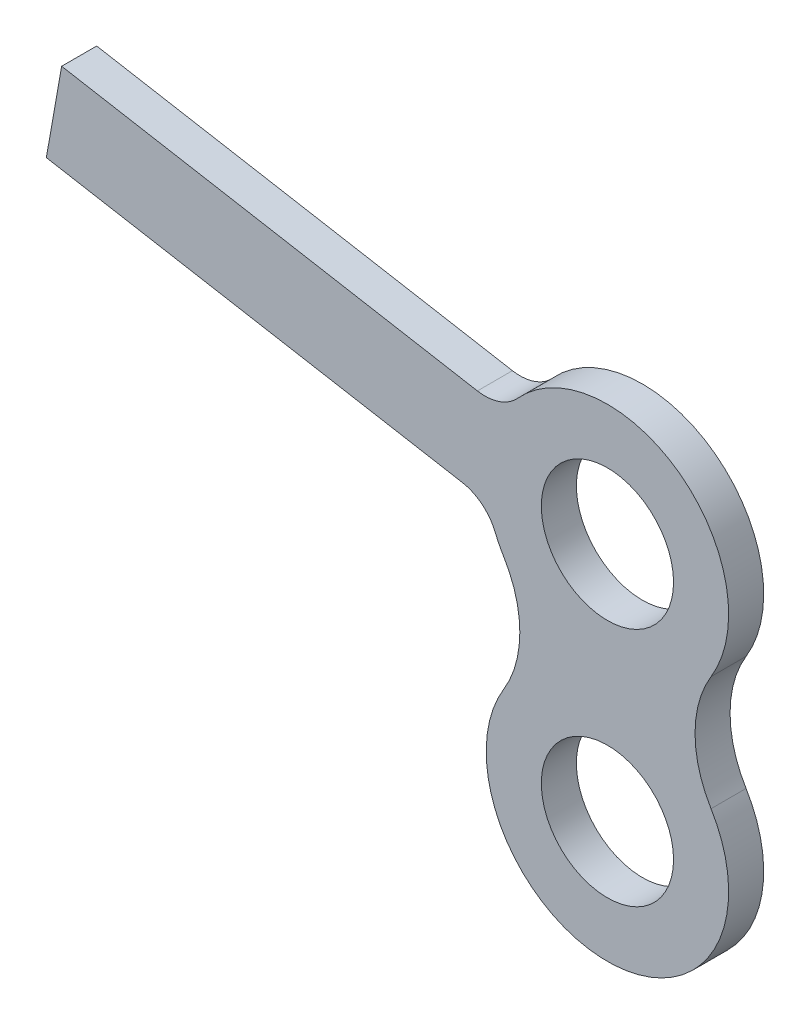
ISO-10303-21;
HEADER;
FILE_DESCRIPTION(('STEP AP214'),'2;1');
FILE_NAME('part.step','',(''),(''),'','','');
FILE_SCHEMA(('AUTOMOTIVE_DESIGN { 1 0 10303 214 1 1 1 1 }'));
ENDSEC;
DATA;
#1=APPLICATION_CONTEXT('core data for automotive mechanical design processes');
#2=APPLICATION_PROTOCOL_DEFINITION('international standard','automotive_design',2000,#1);
#3=PRODUCT_CONTEXT('',#1,'mechanical');
#4=PRODUCT('Part','Part','',(#3));
#5=PRODUCT_RELATED_PRODUCT_CATEGORY('part','',(#4));
#6=PRODUCT_DEFINITION_FORMATION('','',#4);
#7=PRODUCT_DEFINITION_CONTEXT('part definition',#1,'design');
#8=PRODUCT_DEFINITION('design','',#6,#7);
#9=PRODUCT_DEFINITION_SHAPE('','',#8);
#10=(LENGTH_UNIT() NAMED_UNIT(*) SI_UNIT(.MILLI.,.METRE.));
#11=(NAMED_UNIT(*) PLANE_ANGLE_UNIT() SI_UNIT($,.RADIAN.));
#12=(NAMED_UNIT(*) SI_UNIT($,.STERADIAN.) SOLID_ANGLE_UNIT());
#13=UNCERTAINTY_MEASURE_WITH_UNIT(LENGTH_MEASURE(1.E-05),#10,'distance_accuracy_value','');
#14=(GEOMETRIC_REPRESENTATION_CONTEXT(3) GLOBAL_UNCERTAINTY_ASSIGNED_CONTEXT((#13)) GLOBAL_UNIT_ASSIGNED_CONTEXT((#10,
#11,#12)) REPRESENTATION_CONTEXT('',''));
#15=CARTESIAN_POINT('',(0.,0.,0.));
#16=DIRECTION('',(0.,0.,1.));
#17=DIRECTION('',(1.,0.,0.));
#18=AXIS2_PLACEMENT_3D('',#15,#16,#17);
#19=CARTESIAN_POINT('',(-5.55331205759789,15.9409051955912,1.59));
#20=DIRECTION('',(0.,0.,-1.));
#21=DIRECTION('',(-1.,0.,0.));
#22=AXIS2_PLACEMENT_3D('',#19,#20,#21);
#23=CYLINDRICAL_SURFACE('',#22,2.);
#24=CARTESIAN_POINT('',(-5.55331205759789,15.9409051955912,0.));
#25=DIRECTION('',(0.,0.,1.));
#26=DIRECTION('',(1.,0.,0.));
#27=AXIS2_PLACEMENT_3D('',#24,#25,#26);
#28=CIRCLE('',#27,2.);
#29=CARTESIAN_POINT('',(-5.90060841293176,13.9712896895667,0.));
#30=VERTEX_POINT('',#29);
#31=CARTESIAN_POINT('',(-4.07242884223846,14.5966638101002,0.));
#32=VERTEX_POINT('',#31);
#33=EDGE_CURVE('E146',#30,#32,#28,.T.);
#34=ORIENTED_EDGE('',*,*,#33,.F.);
#35=DIRECTION('',(0.,0.,-1.));
#36=VECTOR('',#35,1.);
#37=CARTESIAN_POINT('',(-5.90060841293176,13.9712896895667,1.59));
#38=LINE('',#37,#36);
#39=CARTESIAN_POINT('',(-5.90060841293176,13.9712896895667,1.59));
#40=VERTEX_POINT('',#39);
#41=EDGE_CURVE('E11',#40,#30,#38,.T.);
#42=ORIENTED_EDGE('',*,*,#41,.F.);
#43=CARTESIAN_POINT('',(-5.55331205759789,15.9409051955912,1.59));
#44=DIRECTION('',(0.,0.,1.));
#45=DIRECTION('',(1.,0.,0.));
#46=AXIS2_PLACEMENT_3D('',#43,#44,#45);
#47=CIRCLE('',#46,2.);
#48=CARTESIAN_POINT('',(-4.07242884223846,14.5966638101002,1.59));
#49=VERTEX_POINT('',#48);
#50=EDGE_CURVE('E176',#40,#49,#47,.T.);
#51=ORIENTED_EDGE('',*,*,#50,.T.);
#52=DIRECTION('',(0.,0.,-1.));
#53=VECTOR('',#52,1.);
#54=CARTESIAN_POINT('',(-4.07242884223846,14.5966638101002,1.59));
#55=LINE('',#54,#53);
#56=EDGE_CURVE('E92',#49,#32,#55,.T.);
#57=ORIENTED_EDGE('',*,*,#56,.T.);
#58=EDGE_LOOP('',(#34,#42,#51,#57));
#59=FACE_BOUND('',#58,.T.);
#60=ADVANCED_FACE('F35',(#59),#23,.F.);
#61=CARTESIAN_POINT('',(2.2113061364588,12.5409402893076,1.59));
#62=DIRECTION('',(-0.173648177666934,-0.984807753012207,0.));
#63=DIRECTION('',(0.984807753012207,-0.173648177666934,0.));
#64=AXIS2_PLACEMENT_3D('',#61,#62,#63);
#65=PLANE('',#64);
#66=DIRECTION('',(-0.984807753012208,0.173648177666934,0.));
#67=VECTOR('',#66,1.);
#68=CARTESIAN_POINT('',(2.2113061364588,12.5409402893076,0.));
#69=LINE('',#68,#67);
#70=CARTESIAN_POINT('',(-24.7653013464774,17.2976440365312,0.));
#71=VERTEX_POINT('',#70);
#72=EDGE_CURVE('E149',#30,#71,#69,.T.);
#73=ORIENTED_EDGE('',*,*,#72,.T.);
#74=DIRECTION('',(0.,0.,-1.));
#75=VECTOR('',#74,1.);
#76=CARTESIAN_POINT('',(-24.7653013464774,17.2976440365312,1.59));
#77=LINE('',#76,#75);
#78=CARTESIAN_POINT('',(-24.7653013464774,17.2976440365312,1.59));
#79=VERTEX_POINT('',#78);
#80=EDGE_CURVE('E43',#79,#71,#77,.T.);
#81=ORIENTED_EDGE('',*,*,#80,.F.);
#82=DIRECTION('',(-0.984807753012208,0.173648177666934,0.));
#83=VECTOR('',#82,1.);
#84=CARTESIAN_POINT('',(2.2113061364588,12.5409402893076,1.59));
#85=LINE('',#84,#83);
#86=EDGE_CURVE('E214',#40,#79,#85,.T.);
#87=ORIENTED_EDGE('',*,*,#86,.F.);
#88=ORIENTED_EDGE('',*,*,#41,.T.);
#89=EDGE_LOOP('',(#73,#81,#87,#88));
#90=FACE_BOUND('',#89,.T.);
#91=ADVANCED_FACE('F226',(#90),#65,.F.);
#92=CARTESIAN_POINT('',(-26.9766074829362,4.75670374722361,1.59));
#93=DIRECTION('',(0.984807753012207,-0.173648177666933,0.));
#94=DIRECTION('',(0.173648177666933,0.984807753012208,0.));
#95=AXIS2_PLACEMENT_3D('',#92,#93,#94);
#96=PLANE('',#95);
#97=DIRECTION('',(-0.173648177666933,-0.984807753012208,0.));
#98=VECTOR('',#97,1.);
#99=CARTESIAN_POINT('',(-26.9766074829362,4.75670374722361,0.));
#100=LINE('',#99,#98);
#101=CARTESIAN_POINT('',(-25.4598940571452,13.3584130244824,0.));
#102=VERTEX_POINT('',#101);
#103=EDGE_CURVE('E151',#71,#102,#100,.T.);
#104=ORIENTED_EDGE('',*,*,#103,.T.);
#105=DIRECTION('',(0.,0.,-1.));
#106=VECTOR('',#105,1.);
#107=CARTESIAN_POINT('',(-25.4598940571452,13.3584130244824,1.59));
#108=LINE('',#107,#106);
#109=CARTESIAN_POINT('',(-25.4598940571452,13.3584130244824,1.59));
#110=VERTEX_POINT('',#109);
#111=EDGE_CURVE('E186',#110,#102,#108,.T.);
#112=ORIENTED_EDGE('',*,*,#111,.F.);
#113=DIRECTION('',(-0.173648177666933,-0.984807753012208,0.));
#114=VECTOR('',#113,1.);
#115=CARTESIAN_POINT('',(-26.9766074829362,4.75670374722361,1.59));
#116=LINE('',#115,#114);
#117=EDGE_CURVE('E194',#79,#110,#116,.T.);
#118=ORIENTED_EDGE('',*,*,#117,.F.);
#119=ORIENTED_EDGE('',*,*,#80,.T.);
#120=EDGE_LOOP('',(#104,#112,#118,#119));
#121=FACE_BOUND('',#120,.T.);
#122=ADVANCED_FACE('F192',(#121),#96,.F.);
#123=CARTESIAN_POINT('',(1.51671342579106,8.60170927725877,1.59));
#124=DIRECTION('',(-0.173648177666934,-0.984807753012207,0.));
#125=DIRECTION('',(0.984807753012207,-0.173648177666934,0.));
#126=AXIS2_PLACEMENT_3D('',#123,#124,#125);
#127=PLANE('',#126);
#128=DIRECTION('',(-0.984807753012208,0.173648177666934,0.));
#129=VECTOR('',#128,1.);
#130=CARTESIAN_POINT('',(1.51671342579106,8.60170927725877,0.));
#131=LINE('',#130,#129);
#132=CARTESIAN_POINT('',(-6.59520112359949,10.0320586775179,0.));
#133=VERTEX_POINT('',#132);
#134=EDGE_CURVE('E154',#133,#102,#131,.T.);
#135=ORIENTED_EDGE('',*,*,#134,.F.);
#136=DIRECTION('',(0.,0.,-1.));
#137=VECTOR('',#136,1.);
#138=CARTESIAN_POINT('',(-6.59520112359949,10.0320586775179,1.59));
#139=LINE('',#138,#137);
#140=CARTESIAN_POINT('',(-6.59520112359949,10.0320586775179,1.59));
#141=VERTEX_POINT('',#140);
#142=EDGE_CURVE('E184',#141,#133,#139,.T.);
#143=ORIENTED_EDGE('',*,*,#142,.F.);
#144=DIRECTION('',(-0.984807753012208,0.173648177666934,0.));
#145=VECTOR('',#144,1.);
#146=CARTESIAN_POINT('',(1.51671342579106,8.60170927725877,1.59));
#147=LINE('',#146,#145);
#148=EDGE_CURVE('E207',#141,#110,#147,.T.);
#149=ORIENTED_EDGE('',*,*,#148,.T.);
#150=ORIENTED_EDGE('',*,*,#111,.T.);
#151=EDGE_LOOP('',(#135,#143,#149,#150));
#152=FACE_BOUND('',#151,.T.);
#153=ADVANCED_FACE('F204',(#152),#127,.T.);
#154=CARTESIAN_POINT('',(-6.94249747893336,8.06244317149349,1.59));
#155=DIRECTION('',(0.,0.,-1.));
#156=DIRECTION('',(-1.,0.,0.));
#157=AXIS2_PLACEMENT_3D('',#154,#155,#156);
#158=CYLINDRICAL_SURFACE('',#157,2.);
#159=CARTESIAN_POINT('',(-6.94249747893336,8.06244317149349,0.));
#160=DIRECTION('',(0.,0.,1.));
#161=DIRECTION('',(1.,0.,0.));
#162=AXIS2_PLACEMENT_3D('',#159,#160,#161);
#163=CIRCLE('',#162,2.);
#164=CARTESIAN_POINT('',(-5.09116481788447,8.81912499242856,0.));
#165=VERTEX_POINT('',#164);
#166=EDGE_CURVE('E157',#165,#133,#163,.T.);
#167=ORIENTED_EDGE('',*,*,#166,.F.);
#168=DIRECTION('',(0.,0.,-1.));
#169=VECTOR('',#168,1.);
#170=CARTESIAN_POINT('',(-5.09116481788447,8.81912499242856,1.59));
#171=LINE('',#170,#169);
#172=CARTESIAN_POINT('',(-5.09116481788447,8.81912499242856,1.59));
#173=VERTEX_POINT('',#172);
#174=EDGE_CURVE('E182',#173,#165,#171,.T.);
#175=ORIENTED_EDGE('',*,*,#174,.F.);
#176=CARTESIAN_POINT('',(-6.94249747893336,8.06244317149349,1.59));
#177=DIRECTION('',(0.,0.,1.));
#178=DIRECTION('',(1.,0.,0.));
#179=AXIS2_PLACEMENT_3D('',#176,#177,#178);
#180=CIRCLE('',#179,2.);
#181=EDGE_CURVE('E210',#173,#141,#180,.T.);
#182=ORIENTED_EDGE('',*,*,#181,.T.);
#183=ORIENTED_EDGE('',*,*,#142,.T.);
#184=EDGE_LOOP('',(#167,#175,#182,#183));
#185=FACE_BOUND('',#184,.T.);
#186=ADVANCED_FACE('F236',(#185),#158,.F.);
#187=CARTESIAN_POINT('',(0.,10.9,1.59));
#188=DIRECTION('',(0.,0.,-1.));
#189=DIRECTION('',(-1.,0.,0.));
#190=AXIS2_PLACEMENT_3D('',#187,#188,#189);
#191=CYLINDRICAL_SURFACE('',#190,5.5);
#192=CARTESIAN_POINT('',(0.,10.9,0.));
#193=DIRECTION('',(0.,0.,1.));
#194=DIRECTION('',(1.,0.,0.));
#195=AXIS2_PLACEMENT_3D('',#192,#193,#194);
#196=CIRCLE('',#195,5.5);
#197=CARTESIAN_POINT('',(-4.70109928284015,8.0452380952381,0.));
#198=VERTEX_POINT('',#197);
#199=EDGE_CURVE('E160',#165,#198,#196,.T.);
#200=ORIENTED_EDGE('',*,*,#199,.T.);
#201=DIRECTION('',(0.,0.,-1.));
#202=VECTOR('',#201,1.);
#203=CARTESIAN_POINT('',(-4.70109928284015,8.0452380952381,1.59));
#204=LINE('',#203,#202);
#205=CARTESIAN_POINT('',(-4.70109928284015,8.0452380952381,1.59));
#206=VERTEX_POINT('',#205);
#207=EDGE_CURVE('E180',#206,#198,#204,.T.);
#208=ORIENTED_EDGE('',*,*,#207,.F.);
#209=CARTESIAN_POINT('',(0.,10.9,1.59));
#210=DIRECTION('',(0.,0.,1.));
#211=DIRECTION('',(1.,0.,0.));
#212=AXIS2_PLACEMENT_3D('',#209,#210,#211);
#213=CIRCLE('',#212,5.5);
#214=EDGE_CURVE('E212',#173,#206,#213,.T.);
#215=ORIENTED_EDGE('',*,*,#214,.F.);
#216=ORIENTED_EDGE('',*,*,#174,.T.);
#217=EDGE_LOOP('',(#200,#208,#215,#216));
#218=FACE_BOUND('',#217,.T.);
#219=ADVANCED_FACE('F239',(#218),#191,.T.);
#220=CARTESIAN_POINT('',(-8.97482590360393,5.45,1.59));
#221=DIRECTION('',(0.,0.,-1.));
#222=DIRECTION('',(-1.,0.,0.));
#223=AXIS2_PLACEMENT_3D('',#220,#221,#222);
#224=CYLINDRICAL_SURFACE('',#223,5.);
#225=CARTESIAN_POINT('',(-8.97482590360393,5.45,0.));
#226=DIRECTION('',(0.,0.,1.));
#227=DIRECTION('',(1.,0.,0.));
#228=AXIS2_PLACEMENT_3D('',#225,#226,#227);
#229=CIRCLE('',#228,5.);
#230=CARTESIAN_POINT('',(-4.70109928284015,2.8547619047619,0.));
#231=VERTEX_POINT('',#230);
#232=EDGE_CURVE('E163',#231,#198,#229,.T.);
#233=ORIENTED_EDGE('',*,*,#232,.F.);
#234=DIRECTION('',(0.,0.,-1.));
#235=VECTOR('',#234,1.);
#236=CARTESIAN_POINT('',(-4.70109928284015,2.8547619047619,1.59));
#237=LINE('',#236,#235);
#238=CARTESIAN_POINT('',(-4.70109928284015,2.8547619047619,1.59));
#239=VERTEX_POINT('',#238);
#240=EDGE_CURVE('E132',#239,#231,#237,.T.);
#241=ORIENTED_EDGE('',*,*,#240,.F.);
#242=CARTESIAN_POINT('',(-8.97482590360393,5.45,1.59));
#243=DIRECTION('',(0.,0.,1.));
#244=DIRECTION('',(1.,0.,0.));
#245=AXIS2_PLACEMENT_3D('',#242,#243,#244);
#246=CIRCLE('',#245,5.);
#247=EDGE_CURVE('E125',#239,#206,#246,.T.);
#248=ORIENTED_EDGE('',*,*,#247,.T.);
#249=ORIENTED_EDGE('',*,*,#207,.T.);
#250=EDGE_LOOP('',(#233,#241,#248,#249));
#251=FACE_BOUND('',#250,.T.);
#252=ADVANCED_FACE('F220',(#251),#224,.F.);
#253=CARTESIAN_POINT('',(0.,0.,1.59));
#254=DIRECTION('',(0.,0.,-1.));
#255=DIRECTION('',(-1.,0.,0.));
#256=AXIS2_PLACEMENT_3D('',#253,#254,#255);
#257=CYLINDRICAL_SURFACE('',#256,5.5);
#258=CARTESIAN_POINT('',(0.,0.,0.));
#259=DIRECTION('',(0.,0.,1.));
#260=DIRECTION('',(1.,0.,0.));
#261=AXIS2_PLACEMENT_3D('',#258,#259,#260);
#262=CIRCLE('',#261,5.5);
#263=CARTESIAN_POINT('',(4.70109928284015,2.8547619047619,0.));
#264=VERTEX_POINT('',#263);
#265=EDGE_CURVE('E131',#231,#264,#262,.T.);
#266=ORIENTED_EDGE('',*,*,#265,.T.);
#267=DIRECTION('',(0.,0.,-1.));
#268=VECTOR('',#267,1.);
#269=CARTESIAN_POINT('',(4.70109928284015,2.8547619047619,1.59));
#270=LINE('',#269,#268);
#271=CARTESIAN_POINT('',(4.70109928284015,2.8547619047619,1.59));
#272=VERTEX_POINT('',#271);
#273=EDGE_CURVE('E128',#272,#264,#270,.T.);
#274=ORIENTED_EDGE('',*,*,#273,.F.);
#275=CARTESIAN_POINT('',(0.,0.,1.59));
#276=DIRECTION('',(0.,0.,1.));
#277=DIRECTION('',(1.,0.,0.));
#278=AXIS2_PLACEMENT_3D('',#275,#276,#277);
#279=CIRCLE('',#278,5.5);
#280=EDGE_CURVE('E118',#239,#272,#279,.T.);
#281=ORIENTED_EDGE('',*,*,#280,.F.);
#282=ORIENTED_EDGE('',*,*,#240,.T.);
#283=EDGE_LOOP('',(#266,#274,#281,#282));
#284=FACE_BOUND('',#283,.T.);
#285=ADVANCED_FACE('F129',(#284),#257,.T.);
#286=CARTESIAN_POINT('',(8.97482590360393,5.45,1.59));
#287=DIRECTION('',(0.,0.,-1.));
#288=DIRECTION('',(-1.,0.,0.));
#289=AXIS2_PLACEMENT_3D('',#286,#287,#288);
#290=CYLINDRICAL_SURFACE('',#289,5.);
#291=CARTESIAN_POINT('',(8.97482590360393,5.45,0.));
#292=DIRECTION('',(0.,0.,1.));
#293=DIRECTION('',(1.,0.,0.));
#294=AXIS2_PLACEMENT_3D('',#291,#292,#293);
#295=CIRCLE('',#294,5.);
#296=CARTESIAN_POINT('',(4.70109928284015,8.04523809523809,0.));
#297=VERTEX_POINT('',#296);
#298=EDGE_CURVE('E85',#264,#297,#295,.F.);
#299=ORIENTED_EDGE('',*,*,#298,.T.);
#300=DIRECTION('',(0.,0.,-1.));
#301=VECTOR('',#300,1.);
#302=CARTESIAN_POINT('',(4.70109928284015,8.04523809523809,1.59));
#303=LINE('',#302,#301);
#304=CARTESIAN_POINT('',(4.70109928284015,8.04523809523809,1.59));
#305=VERTEX_POINT('',#304);
#306=EDGE_CURVE('E133',#305,#297,#303,.T.);
#307=ORIENTED_EDGE('',*,*,#306,.F.);
#308=CARTESIAN_POINT('',(8.97482590360393,5.45,1.59));
#309=DIRECTION('',(0.,0.,1.));
#310=DIRECTION('',(1.,0.,0.));
#311=AXIS2_PLACEMENT_3D('',#308,#309,#310);
#312=CIRCLE('',#311,5.);
#313=EDGE_CURVE('E123',#272,#305,#312,.F.);
#314=ORIENTED_EDGE('',*,*,#313,.F.);
#315=ORIENTED_EDGE('',*,*,#273,.T.);
#316=EDGE_LOOP('',(#299,#307,#314,#315));
#317=FACE_BOUND('',#316,.T.);
#318=ADVANCED_FACE('F135',(#317),#290,.F.);
#319=CARTESIAN_POINT('',(0.,0.,1.59));
#320=DIRECTION('',(0.,0.,-1.));
#321=DIRECTION('',(-1.,0.,0.));
#322=AXIS2_PLACEMENT_3D('',#319,#320,#321);
#323=CYLINDRICAL_SURFACE('',#322,3.);
#324=CARTESIAN_POINT('',(0.,0.,1.59));
#325=DIRECTION('',(0.,0.,1.));
#326=DIRECTION('',(1.,0.,0.));
#327=AXIS2_PLACEMENT_3D('',#324,#325,#326);
#328=CIRCLE('',#327,3.);
#329=CARTESIAN_POINT('',(3.,0.,1.59));
#330=VERTEX_POINT('',#329);
#331=EDGE_CURVE('E137',#330,#330,#328,.T.);
#332=ORIENTED_EDGE('',*,*,#331,.T.);
#333=EDGE_LOOP('',(#332));
#334=FACE_BOUND('',#333,.T.);
#335=CARTESIAN_POINT('',(0.,0.,0.));
#336=DIRECTION('',(0.,0.,1.));
#337=DIRECTION('',(1.,0.,0.));
#338=AXIS2_PLACEMENT_3D('',#335,#336,#337);
#339=CIRCLE('',#338,3.);
#340=CARTESIAN_POINT('',(3.,0.,0.));
#341=VERTEX_POINT('',#340);
#342=EDGE_CURVE('E170',#341,#341,#339,.T.);
#343=ORIENTED_EDGE('',*,*,#342,.F.);
#344=EDGE_LOOP('',(#343));
#345=FACE_BOUND('',#344,.T.);
#346=ADVANCED_FACE('F250',(#334,#345),#323,.F.);
#347=CARTESIAN_POINT('',(0.,10.9,1.59));
#348=DIRECTION('',(0.,0.,-1.));
#349=DIRECTION('',(-1.,0.,0.));
#350=AXIS2_PLACEMENT_3D('',#347,#348,#349);
#351=CYLINDRICAL_SURFACE('',#350,5.5);
#352=CARTESIAN_POINT('',(0.,10.9,0.));
#353=DIRECTION('',(0.,0.,1.));
#354=DIRECTION('',(1.,0.,0.));
#355=AXIS2_PLACEMENT_3D('',#352,#353,#354);
#356=CIRCLE('',#355,5.5);
#357=EDGE_CURVE('E168',#297,#32,#356,.T.);
#358=ORIENTED_EDGE('',*,*,#357,.T.);
#359=ORIENTED_EDGE('',*,*,#56,.F.);
#360=CARTESIAN_POINT('',(0.,10.9,1.59));
#361=DIRECTION('',(0.,0.,1.));
#362=DIRECTION('',(1.,0.,0.));
#363=AXIS2_PLACEMENT_3D('',#360,#361,#362);
#364=CIRCLE('',#363,5.5);
#365=EDGE_CURVE('E51',#305,#49,#364,.T.);
#366=ORIENTED_EDGE('',*,*,#365,.F.);
#367=ORIENTED_EDGE('',*,*,#306,.T.);
#368=EDGE_LOOP('',(#358,#359,#366,#367));
#369=FACE_BOUND('',#368,.T.);
#370=ADVANCED_FACE('F224',(#369),#351,.T.);
#371=CARTESIAN_POINT('',(0.,10.9,1.59));
#372=DIRECTION('',(0.,0.,-1.));
#373=DIRECTION('',(-1.,0.,0.));
#374=AXIS2_PLACEMENT_3D('',#371,#372,#373);
#375=CYLINDRICAL_SURFACE('',#374,3.);
#376=CARTESIAN_POINT('',(0.,10.9,1.59));
#377=DIRECTION('',(0.,0.,1.));
#378=DIRECTION('',(1.,0.,0.));
#379=AXIS2_PLACEMENT_3D('',#376,#377,#378);
#380=CIRCLE('',#379,3.);
#381=CARTESIAN_POINT('',(3.,10.9,1.59));
#382=VERTEX_POINT('',#381);
#383=EDGE_CURVE('E143',#382,#382,#380,.T.);
#384=ORIENTED_EDGE('',*,*,#383,.T.);
#385=EDGE_LOOP('',(#384));
#386=FACE_BOUND('',#385,.T.);
#387=CARTESIAN_POINT('',(0.,10.9,0.));
#388=DIRECTION('',(0.,0.,1.));
#389=DIRECTION('',(1.,0.,0.));
#390=AXIS2_PLACEMENT_3D('',#387,#388,#389);
#391=CIRCLE('',#390,3.);
#392=CARTESIAN_POINT('',(3.,10.9,0.));
#393=VERTEX_POINT('',#392);
#394=EDGE_CURVE('E173',#393,#393,#391,.T.);
#395=ORIENTED_EDGE('',*,*,#394,.F.);
#396=EDGE_LOOP('',(#395));
#397=FACE_BOUND('',#396,.T.);
#398=ADVANCED_FACE('F253',(#386,#397),#375,.F.);
#399=CARTESIAN_POINT('',(0.,0.,1.59));
#400=DIRECTION('',(0.,0.,1.));
#401=DIRECTION('',(1.,0.,0.));
#402=AXIS2_PLACEMENT_3D('',#399,#400,#401);
#403=PLANE('',#402);
#404=ORIENTED_EDGE('',*,*,#50,.F.);
#405=ORIENTED_EDGE('',*,*,#86,.T.);
#406=ORIENTED_EDGE('',*,*,#117,.T.);
#407=ORIENTED_EDGE('',*,*,#148,.F.);
#408=ORIENTED_EDGE('',*,*,#181,.F.);
#409=ORIENTED_EDGE('',*,*,#214,.T.);
#410=ORIENTED_EDGE('',*,*,#247,.F.);
#411=ORIENTED_EDGE('',*,*,#280,.T.);
#412=ORIENTED_EDGE('',*,*,#313,.T.);
#413=ORIENTED_EDGE('',*,*,#365,.T.);
#414=EDGE_LOOP('',(#404,#405,#406,#407,#408,#409,#410,#411,#412,#413));
#415=FACE_BOUND('',#414,.T.);
#416=ORIENTED_EDGE('',*,*,#331,.F.);
#417=EDGE_LOOP('',(#416));
#418=FACE_BOUND('',#417,.T.);
#419=ORIENTED_EDGE('',*,*,#383,.F.);
#420=EDGE_LOOP('',(#419));
#421=FACE_BOUND('',#420,.T.);
#422=ADVANCED_FACE('F120',(#415,#418,#421),#403,.T.);
#423=CARTESIAN_POINT('',(0.,0.,0.));
#424=DIRECTION('',(0.,0.,1.));
#425=DIRECTION('',(1.,0.,0.));
#426=AXIS2_PLACEMENT_3D('',#423,#424,#425);
#427=PLANE('',#426);
#428=ORIENTED_EDGE('',*,*,#33,.T.);
#429=ORIENTED_EDGE('',*,*,#357,.F.);
#430=ORIENTED_EDGE('',*,*,#298,.F.);
#431=ORIENTED_EDGE('',*,*,#265,.F.);
#432=ORIENTED_EDGE('',*,*,#232,.T.);
#433=ORIENTED_EDGE('',*,*,#199,.F.);
#434=ORIENTED_EDGE('',*,*,#166,.T.);
#435=ORIENTED_EDGE('',*,*,#134,.T.);
#436=ORIENTED_EDGE('',*,*,#103,.F.);
#437=ORIENTED_EDGE('',*,*,#72,.F.);
#438=EDGE_LOOP('',(#428,#429,#430,#431,#432,#433,#434,#435,#436,#437));
#439=FACE_BOUND('',#438,.T.);
#440=ORIENTED_EDGE('',*,*,#342,.T.);
#441=EDGE_LOOP('',(#440));
#442=FACE_BOUND('',#441,.T.);
#443=ORIENTED_EDGE('',*,*,#394,.T.);
#444=EDGE_LOOP('',(#443));
#445=FACE_BOUND('',#444,.T.);
#446=ADVANCED_FACE('F198',(#439,#442,#445),#427,.F.);
#447=CLOSED_SHELL('',(#60,#91,#122,#153,#186,#219,#252,#285,#318,#346,#370,#398,#422,#446));
#448=MANIFOLD_SOLID_BREP('B2',#447);
#449=ADVANCED_BREP_SHAPE_REPRESENTATION('',(#18,#448),#14);
#450=SHAPE_DEFINITION_REPRESENTATION(#9,#449);
ENDSEC;
END-ISO-10303-21;
